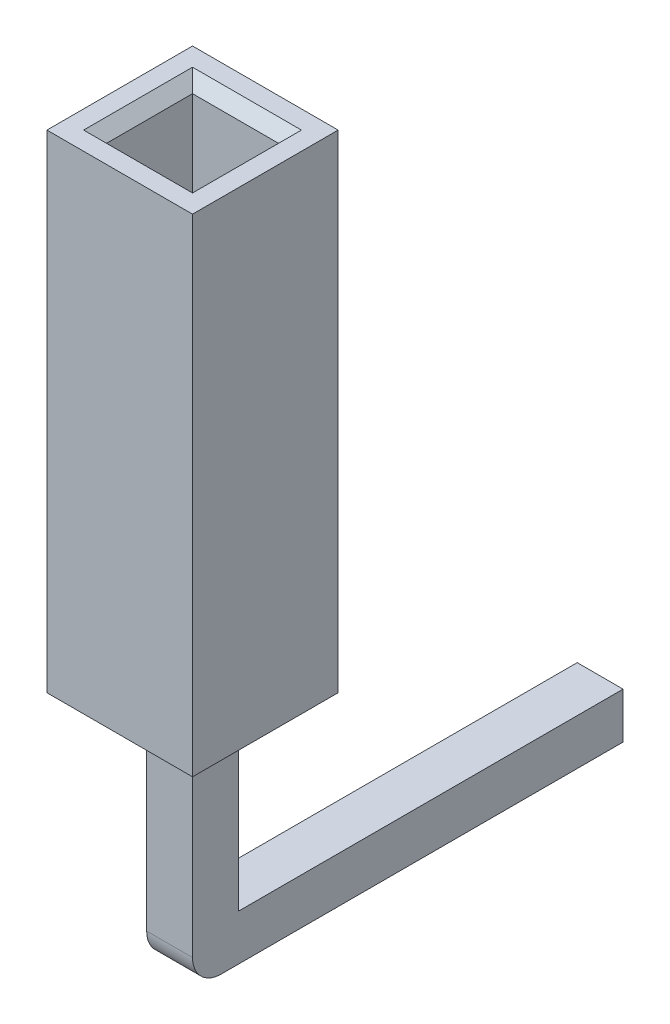
ISO-10303-21;
HEADER;
FILE_DESCRIPTION(('STEP AP214'),'2;1');
FILE_NAME('part.step','',(''),(''),'','','');
FILE_SCHEMA(('AUTOMOTIVE_DESIGN { 1 0 10303 214 1 1 1 1 }'));
ENDSEC;
DATA;
#1=APPLICATION_CONTEXT('core data for automotive mechanical design processes');
#2=APPLICATION_PROTOCOL_DEFINITION('international standard','automotive_design',2000,#1);
#3=PRODUCT_CONTEXT('',#1,'mechanical');
#4=PRODUCT('Part','Part','',(#3));
#5=PRODUCT_RELATED_PRODUCT_CATEGORY('part','',(#4));
#6=PRODUCT_DEFINITION_FORMATION('','',#4);
#7=PRODUCT_DEFINITION_CONTEXT('part definition',#1,'design');
#8=PRODUCT_DEFINITION('design','',#6,#7);
#9=PRODUCT_DEFINITION_SHAPE('','',#8);
#10=(LENGTH_UNIT() NAMED_UNIT(*) SI_UNIT(.MILLI.,.METRE.));
#11=(NAMED_UNIT(*) PLANE_ANGLE_UNIT() SI_UNIT($,.RADIAN.));
#12=(NAMED_UNIT(*) SI_UNIT($,.STERADIAN.) SOLID_ANGLE_UNIT());
#13=UNCERTAINTY_MEASURE_WITH_UNIT(LENGTH_MEASURE(1.E-05),#10,'distance_accuracy_value','');
#14=(GEOMETRIC_REPRESENTATION_CONTEXT(3) GLOBAL_UNCERTAINTY_ASSIGNED_CONTEXT((#13)) GLOBAL_UNIT_ASSIGNED_CONTEXT((#10,
#11,#12)) REPRESENTATION_CONTEXT('',''));
#15=CARTESIAN_POINT('',(0.,0.,0.));
#16=DIRECTION('',(0.,0.,1.));
#17=DIRECTION('',(1.,0.,0.));
#18=AXIS2_PLACEMENT_3D('',#15,#16,#17);
#19=CARTESIAN_POINT('',(0.87,-4.1,-0.87));
#20=DIRECTION('',(0.,-1.,0.));
#21=DIRECTION('',(0.,0.,-1.));
#22=AXIS2_PLACEMENT_3D('',#19,#20,#21);
#23=PLANE('',#22);
#24=DIRECTION('',(0.,0.,-1.));
#25=VECTOR('',#24,1.);
#26=CARTESIAN_POINT('',(1.67,-4.1,-0.87));
#27=LINE('',#26,#25);
#28=CARTESIAN_POINT('',(1.67,-4.1,-1.37));
#29=VERTEX_POINT('',#28);
#30=CARTESIAN_POINT('',(1.67,-4.1,-8.38));
#31=VERTEX_POINT('',#30);
#32=EDGE_CURVE('E151',#29,#31,#27,.T.);
#33=ORIENTED_EDGE('',*,*,#32,.F.);
#34=DIRECTION('',(-1.,0.,0.));
#35=VECTOR('',#34,1.);
#36=CARTESIAN_POINT('',(0.87,-4.1,-1.37));
#37=LINE('',#36,#35);
#38=CARTESIAN_POINT('',(0.87,-4.1,-1.37));
#39=VERTEX_POINT('',#38);
#40=EDGE_CURVE('E181',#29,#39,#37,.T.);
#41=ORIENTED_EDGE('',*,*,#40,.T.);
#42=DIRECTION('',(0.,0.,-1.));
#43=VECTOR('',#42,1.);
#44=CARTESIAN_POINT('',(0.87,-4.1,-0.87));
#45=LINE('',#44,#43);
#46=CARTESIAN_POINT('',(0.87,-4.1,-8.38));
#47=VERTEX_POINT('',#46);
#48=EDGE_CURVE('E159',#39,#47,#45,.T.);
#49=ORIENTED_EDGE('',*,*,#48,.T.);
#50=DIRECTION('',(1.,0.,0.));
#51=VECTOR('',#50,1.);
#52=CARTESIAN_POINT('',(0.87,-4.1,-8.38));
#53=LINE('',#52,#51);
#54=EDGE_CURVE('E176',#47,#31,#53,.T.);
#55=ORIENTED_EDGE('',*,*,#54,.T.);
#56=EDGE_LOOP('',(#33,#41,#49,#55));
#57=FACE_BOUND('',#56,.T.);
#58=ADVANCED_FACE('F47',(#57),#23,.T.);
#59=CARTESIAN_POINT('',(0.87,-3.3,-1.67));
#60=DIRECTION('',(0.,1.,0.));
#61=DIRECTION('',(0.,0.,1.));
#62=AXIS2_PLACEMENT_3D('',#59,#60,#61);
#63=PLANE('',#62);
#64=DIRECTION('',(0.,0.,-1.));
#65=VECTOR('',#64,1.);
#66=CARTESIAN_POINT('',(1.67,-3.3,-1.67));
#67=LINE('',#66,#65);
#68=CARTESIAN_POINT('',(1.67,-3.3,-1.67));
#69=VERTEX_POINT('',#68);
#70=CARTESIAN_POINT('',(1.67,-3.3,-8.38));
#71=VERTEX_POINT('',#70);
#72=EDGE_CURVE('E153',#69,#71,#67,.T.);
#73=ORIENTED_EDGE('',*,*,#72,.T.);
#74=DIRECTION('',(-1.,0.,0.));
#75=VECTOR('',#74,1.);
#76=CARTESIAN_POINT('',(0.87,-3.3,-8.38));
#77=LINE('',#76,#75);
#78=CARTESIAN_POINT('',(0.87,-3.3,-8.38));
#79=VERTEX_POINT('',#78);
#80=EDGE_CURVE('E161',#71,#79,#77,.T.);
#81=ORIENTED_EDGE('',*,*,#80,.T.);
#82=DIRECTION('',(0.,0.,-1.));
#83=VECTOR('',#82,1.);
#84=CARTESIAN_POINT('',(0.87,-3.3,-1.67));
#85=LINE('',#84,#83);
#86=CARTESIAN_POINT('',(0.87,-3.3,-1.67));
#87=VERTEX_POINT('',#86);
#88=EDGE_CURVE('E156',#87,#79,#85,.T.);
#89=ORIENTED_EDGE('',*,*,#88,.F.);
#90=DIRECTION('',(1.,0.,0.));
#91=VECTOR('',#90,1.);
#92=CARTESIAN_POINT('',(0.87,-3.3,-1.67));
#93=LINE('',#92,#91);
#94=EDGE_CURVE('E122',#87,#69,#93,.T.);
#95=ORIENTED_EDGE('',*,*,#94,.T.);
#96=EDGE_LOOP('',(#73,#81,#89,#95));
#97=FACE_BOUND('',#96,.T.);
#98=ADVANCED_FACE('F220',(#97),#63,.T.);
#99=CARTESIAN_POINT('',(0.87,-4.83137084989847,-0.87));
#100=DIRECTION('',(0.,0.,-1.));
#101=DIRECTION('',(0.,1.,0.));
#102=AXIS2_PLACEMENT_3D('',#99,#100,#101);
#103=PLANE('',#102);
#104=DIRECTION('',(0.,1.,0.));
#105=VECTOR('',#104,1.);
#106=CARTESIAN_POINT('',(0.87,-4.83137084989847,-0.87));
#107=LINE('',#106,#105);
#108=CARTESIAN_POINT('',(0.87,-3.6,-0.87));
#109=VERTEX_POINT('',#108);
#110=CARTESIAN_POINT('',(0.87,0.,-0.87));
#111=VERTEX_POINT('',#110);
#112=EDGE_CURVE('E123',#109,#111,#107,.T.);
#113=ORIENTED_EDGE('',*,*,#112,.F.);
#114=DIRECTION('',(-1.,0.,0.));
#115=VECTOR('',#114,1.);
#116=CARTESIAN_POINT('',(1.67,-3.6,-0.87));
#117=LINE('',#116,#115);
#118=CARTESIAN_POINT('',(1.67,-3.6,-0.87));
#119=VERTEX_POINT('',#118);
#120=EDGE_CURVE('E55',#109,#119,#117,.F.);
#121=ORIENTED_EDGE('',*,*,#120,.T.);
#122=DIRECTION('',(0.,1.,0.));
#123=VECTOR('',#122,1.);
#124=CARTESIAN_POINT('',(1.67,-4.83137084989847,-0.87));
#125=LINE('',#124,#123);
#126=CARTESIAN_POINT('',(1.67,0.,-0.87));
#127=VERTEX_POINT('',#126);
#128=EDGE_CURVE('E114',#119,#127,#125,.T.);
#129=ORIENTED_EDGE('',*,*,#128,.T.);
#130=DIRECTION('',(-1.,0.,0.));
#131=VECTOR('',#130,1.);
#132=CARTESIAN_POINT('',(0.87,0.,-0.87));
#133=LINE('',#132,#131);
#134=EDGE_CURVE('E117',#127,#111,#133,.T.);
#135=ORIENTED_EDGE('',*,*,#134,.T.);
#136=EDGE_LOOP('',(#113,#121,#129,#135));
#137=FACE_BOUND('',#136,.T.);
#138=ADVANCED_FACE('F116',(#137),#103,.F.);
#139=CARTESIAN_POINT('',(0.87,-4.83137084989847,-0.87));
#140=DIRECTION('',(1.,0.,0.));
#141=DIRECTION('',(0.,0.,-1.));
#142=AXIS2_PLACEMENT_3D('',#139,#140,#141);
#143=PLANE('',#142);
#144=ORIENTED_EDGE('',*,*,#48,.F.);
#145=CARTESIAN_POINT('',(0.87,-3.6,-1.37));
#146=DIRECTION('',(1.,0.,0.));
#147=DIRECTION('',(0.,0.,-1.));
#148=AXIS2_PLACEMENT_3D('',#145,#146,#147);
#149=CIRCLE('',#148,0.5);
#150=EDGE_CURVE('E69',#39,#109,#149,.F.);
#151=ORIENTED_EDGE('',*,*,#150,.T.);
#152=ORIENTED_EDGE('',*,*,#112,.T.);
#153=DIRECTION('',(0.,0.,-1.));
#154=VECTOR('',#153,1.);
#155=CARTESIAN_POINT('',(0.87,0.,-0.87));
#156=LINE('',#155,#154);
#157=CARTESIAN_POINT('',(0.87,0.,-1.67));
#158=VERTEX_POINT('',#157);
#159=EDGE_CURVE('E131',#111,#158,#156,.T.);
#160=ORIENTED_EDGE('',*,*,#159,.T.);
#161=DIRECTION('',(0.,1.,0.));
#162=VECTOR('',#161,1.);
#163=CARTESIAN_POINT('',(0.87,-4.83137084989847,-1.67));
#164=LINE('',#163,#162);
#165=EDGE_CURVE('E148',#87,#158,#164,.T.);
#166=ORIENTED_EDGE('',*,*,#165,.F.);
#167=ORIENTED_EDGE('',*,*,#88,.T.);
#168=DIRECTION('',(0.,-1.,0.));
#169=VECTOR('',#168,1.);
#170=CARTESIAN_POINT('',(0.870000000000002,-4.1,-8.38));
#171=LINE('',#170,#169);
#172=EDGE_CURVE('E173',#79,#47,#171,.T.);
#173=ORIENTED_EDGE('',*,*,#172,.T.);
#174=EDGE_LOOP('',(#144,#151,#152,#160,#166,#167,#173));
#175=FACE_BOUND('',#174,.T.);
#176=ADVANCED_FACE('F194',(#175),#143,.F.);
#177=CARTESIAN_POINT('',(0.87,-4.83137084989847,-1.67));
#178=DIRECTION('',(0.,0.,1.));
#179=DIRECTION('',(0.,-1.,0.));
#180=AXIS2_PLACEMENT_3D('',#177,#178,#179);
#181=PLANE('',#180);
#182=ORIENTED_EDGE('',*,*,#94,.F.);
#183=ORIENTED_EDGE('',*,*,#165,.T.);
#184=DIRECTION('',(1.,0.,0.));
#185=VECTOR('',#184,1.);
#186=CARTESIAN_POINT('',(0.87,0.,-1.67));
#187=LINE('',#186,#185);
#188=CARTESIAN_POINT('',(1.67,0.,-1.67));
#189=VERTEX_POINT('',#188);
#190=EDGE_CURVE('E145',#158,#189,#187,.T.);
#191=ORIENTED_EDGE('',*,*,#190,.T.);
#192=DIRECTION('',(0.,1.,0.));
#193=VECTOR('',#192,1.);
#194=CARTESIAN_POINT('',(1.67,-4.83137084989847,-1.67));
#195=LINE('',#194,#193);
#196=EDGE_CURVE('E135',#69,#189,#195,.T.);
#197=ORIENTED_EDGE('',*,*,#196,.F.);
#198=EDGE_LOOP('',(#182,#183,#191,#197));
#199=FACE_BOUND('',#198,.T.);
#200=ADVANCED_FACE('F223',(#199),#181,.F.);
#201=CARTESIAN_POINT('',(1.67,-4.83137084989847,-0.87));
#202=DIRECTION('',(-1.,0.,0.));
#203=DIRECTION('',(0.,0.,1.));
#204=AXIS2_PLACEMENT_3D('',#201,#202,#203);
#205=PLANE('',#204);
#206=ORIENTED_EDGE('',*,*,#128,.F.);
#207=CARTESIAN_POINT('',(1.67,-3.6,-1.37));
#208=DIRECTION('',(-1.,0.,0.));
#209=DIRECTION('',(0.,0.,1.));
#210=AXIS2_PLACEMENT_3D('',#207,#208,#209);
#211=CIRCLE('',#210,0.5);
#212=EDGE_CURVE('E13',#119,#29,#211,.F.);
#213=ORIENTED_EDGE('',*,*,#212,.T.);
#214=ORIENTED_EDGE('',*,*,#32,.T.);
#215=DIRECTION('',(0.,1.,0.));
#216=VECTOR('',#215,1.);
#217=CARTESIAN_POINT('',(1.67,-3.3,-8.38));
#218=LINE('',#217,#216);
#219=EDGE_CURVE('E179',#31,#71,#218,.T.);
#220=ORIENTED_EDGE('',*,*,#219,.T.);
#221=ORIENTED_EDGE('',*,*,#72,.F.);
#222=ORIENTED_EDGE('',*,*,#196,.T.);
#223=DIRECTION('',(0.,0.,1.));
#224=VECTOR('',#223,1.);
#225=CARTESIAN_POINT('',(1.67,0.,-0.87));
#226=LINE('',#225,#224);
#227=EDGE_CURVE('E129',#189,#127,#226,.T.);
#228=ORIENTED_EDGE('',*,*,#227,.T.);
#229=EDGE_LOOP('',(#206,#213,#214,#220,#221,#222,#228));
#230=FACE_BOUND('',#229,.T.);
#231=ADVANCED_FACE('F133',(#230),#205,.F.);
#232=CARTESIAN_POINT('',(0.,0.,0.));
#233=DIRECTION('',(0.,-1.,0.));
#234=DIRECTION('',(0.,0.,-1.));
#235=AXIS2_PLACEMENT_3D('',#232,#233,#234);
#236=PLANE('',#235);
#237=ORIENTED_EDGE('',*,*,#227,.F.);
#238=ORIENTED_EDGE('',*,*,#190,.F.);
#239=ORIENTED_EDGE('',*,*,#159,.F.);
#240=ORIENTED_EDGE('',*,*,#134,.F.);
#241=EDGE_LOOP('',(#237,#238,#239,#240));
#242=FACE_BOUND('',#241,.T.);
#243=ADVANCED_FACE('F127',(#242),#236,.F.);
#244=CARTESIAN_POINT('',(1.27,-3.7,-8.58));
#245=DIRECTION('',(0.,0.,-1.));
#246=DIRECTION('',(-1.,0.,0.));
#247=AXIS2_PLACEMENT_3D('',#244,#245,#246);
#248=PLANE('',#247);
#249=DIRECTION('',(0.,1.,0.));
#250=VECTOR('',#249,1.);
#251=CARTESIAN_POINT('',(1.07,-3.3,-8.58));
#252=LINE('',#251,#250);
#253=CARTESIAN_POINT('',(1.07,-3.9,-8.58));
#254=VERTEX_POINT('',#253);
#255=CARTESIAN_POINT('',(1.07,-3.5,-8.58));
#256=VERTEX_POINT('',#255);
#257=EDGE_CURVE('E168',#254,#256,#252,.T.);
#258=ORIENTED_EDGE('',*,*,#257,.T.);
#259=DIRECTION('',(1.,0.,0.));
#260=VECTOR('',#259,1.);
#261=CARTESIAN_POINT('',(1.27,-3.5,-8.58));
#262=LINE('',#261,#260);
#263=CARTESIAN_POINT('',(1.47,-3.5,-8.58));
#264=VERTEX_POINT('',#263);
#265=EDGE_CURVE('E170',#256,#264,#262,.T.);
#266=ORIENTED_EDGE('',*,*,#265,.T.);
#267=DIRECTION('',(0.,-1.,0.));
#268=VECTOR('',#267,1.);
#269=CARTESIAN_POINT('',(1.47,-4.1,-8.58));
#270=LINE('',#269,#268);
#271=CARTESIAN_POINT('',(1.47,-3.9,-8.58));
#272=VERTEX_POINT('',#271);
#273=EDGE_CURVE('E164',#264,#272,#270,.T.);
#274=ORIENTED_EDGE('',*,*,#273,.T.);
#275=DIRECTION('',(-1.,0.,0.));
#276=VECTOR('',#275,1.);
#277=CARTESIAN_POINT('',(1.27,-3.9,-8.58));
#278=LINE('',#277,#276);
#279=EDGE_CURVE('E166',#272,#254,#278,.T.);
#280=ORIENTED_EDGE('',*,*,#279,.T.);
#281=EDGE_LOOP('',(#258,#266,#274,#280));
#282=FACE_BOUND('',#281,.T.);
#283=ADVANCED_FACE('F210',(#282),#248,.T.);
#284=CARTESIAN_POINT('',(0.87,-4.1,-8.38));
#285=DIRECTION('',(0.,0.707106781186547,0.707106781186547));
#286=DIRECTION('',(1.,0.,0.));
#287=AXIS2_PLACEMENT_3D('',#284,#285,#286);
#288=PLANE('',#287);
#289=DIRECTION('',(-0.577350269189626,-0.577350269189626,0.577350269189626));
#290=VECTOR('',#289,1.);
#291=CARTESIAN_POINT('',(0.870000000000001,-4.1,-8.38));
#292=LINE('',#291,#290);
#293=EDGE_CURVE('E140',#254,#47,#292,.T.);
#294=ORIENTED_EDGE('',*,*,#293,.F.);
#295=ORIENTED_EDGE('',*,*,#279,.F.);
#296=DIRECTION('',(0.577350269189626,-0.577350269189626,0.577350269189626));
#297=VECTOR('',#296,1.);
#298=CARTESIAN_POINT('',(1.91379028329949,-4.34379028329949,-8.13620971670051));
#299=LINE('',#298,#297);
#300=EDGE_CURVE('E137',#31,#272,#299,.F.);
#301=ORIENTED_EDGE('',*,*,#300,.F.);
#302=ORIENTED_EDGE('',*,*,#54,.F.);
#303=EDGE_LOOP('',(#294,#295,#301,#302));
#304=FACE_BOUND('',#303,.T.);
#305=ADVANCED_FACE('F203',(#304),#288,.F.);
#306=CARTESIAN_POINT('',(1.67,-4.83137084989847,-8.38));
#307=DIRECTION('',(0.707106781186547,0.,-0.707106781186547));
#308=DIRECTION('',(0.,-1.,0.));
#309=AXIS2_PLACEMENT_3D('',#306,#307,#308);
#310=PLANE('',#309);
#311=ORIENTED_EDGE('',*,*,#300,.T.);
#312=ORIENTED_EDGE('',*,*,#273,.F.);
#313=DIRECTION('',(-0.577350269189626,-0.577350269189626,-0.577350269189626));
#314=VECTOR('',#313,1.);
#315=CARTESIAN_POINT('',(1.15954305003384,-3.81045694996616,-8.89045694996616));
#316=LINE('',#315,#314);
#317=EDGE_CURVE('E184',#71,#264,#316,.T.);
#318=ORIENTED_EDGE('',*,*,#317,.F.);
#319=ORIENTED_EDGE('',*,*,#219,.F.);
#320=EDGE_LOOP('',(#311,#312,#318,#319));
#321=FACE_BOUND('',#320,.T.);
#322=ADVANCED_FACE('F217',(#321),#310,.T.);
#323=CARTESIAN_POINT('',(0.870000000000002,-4.83137084989847,-8.38));
#324=DIRECTION('',(-0.707106781186548,0.,-0.707106781186547));
#325=DIRECTION('',(0.,1.,0.));
#326=AXIS2_PLACEMENT_3D('',#323,#324,#325);
#327=PLANE('',#326);
#328=ORIENTED_EDGE('',*,*,#293,.T.);
#329=ORIENTED_EDGE('',*,*,#172,.F.);
#330=DIRECTION('',(-0.577350269189626,0.577350269189626,0.577350269189626));
#331=VECTOR('',#330,1.);
#332=CARTESIAN_POINT('',(1.38045694996616,-3.81045694996616,-8.89045694996616));
#333=LINE('',#332,#331);
#334=EDGE_CURVE('E182',#256,#79,#333,.T.);
#335=ORIENTED_EDGE('',*,*,#334,.F.);
#336=ORIENTED_EDGE('',*,*,#257,.F.);
#337=EDGE_LOOP('',(#328,#329,#335,#336));
#338=FACE_BOUND('',#337,.T.);
#339=ADVANCED_FACE('F207',(#338),#327,.T.);
#340=CARTESIAN_POINT('',(0.87,-3.3,-8.38));
#341=DIRECTION('',(0.,-0.707106781186547,0.707106781186547));
#342=DIRECTION('',(-1.,0.,0.));
#343=AXIS2_PLACEMENT_3D('',#340,#341,#342);
#344=PLANE('',#343);
#345=ORIENTED_EDGE('',*,*,#317,.T.);
#346=ORIENTED_EDGE('',*,*,#265,.F.);
#347=ORIENTED_EDGE('',*,*,#334,.T.);
#348=ORIENTED_EDGE('',*,*,#80,.F.);
#349=EDGE_LOOP('',(#345,#346,#347,#348));
#350=FACE_BOUND('',#349,.T.);
#351=ADVANCED_FACE('F212',(#350),#344,.F.);
#352=CARTESIAN_POINT('',(0.87,-3.6,-1.37));
#353=DIRECTION('',(1.,0.,0.));
#354=DIRECTION('',(0.,0.,-1.));
#355=AXIS2_PLACEMENT_3D('',#352,#353,#354);
#356=CYLINDRICAL_SURFACE('',#355,0.5);
#357=ORIENTED_EDGE('',*,*,#212,.F.);
#358=ORIENTED_EDGE('',*,*,#120,.F.);
#359=ORIENTED_EDGE('',*,*,#150,.F.);
#360=ORIENTED_EDGE('',*,*,#40,.F.);
#361=EDGE_LOOP('',(#357,#358,#359,#360));
#362=FACE_BOUND('',#361,.T.);
#363=ADVANCED_FACE('F49',(#362),#356,.T.);
#364=CLOSED_SHELL('',(#58,#98,#138,#176,#200,#231,#243,#283,#305,#322,#339,#351,#363));
#365=MANIFOLD_SOLID_BREP('B2',#364);
#366=CARTESIAN_POINT('',(0.,8.5,0.));
#367=DIRECTION('',(0.,-1.,0.));
#368=DIRECTION('',(0.,0.,-1.));
#369=AXIS2_PLACEMENT_3D('',#366,#367,#368);
#370=PLANE('',#369);
#371=DIRECTION('',(0.,0.,-1.));
#372=VECTOR('',#371,1.);
#373=CARTESIAN_POINT('',(0.320000000000002,8.5,-2.02));
#374=LINE('',#373,#372);
#375=CARTESIAN_POINT('',(0.320000000000002,8.5,-0.320000000000002));
#376=VERTEX_POINT('',#375);
#377=CARTESIAN_POINT('',(0.320000000000002,8.5,-2.22));
#378=VERTEX_POINT('',#377);
#379=EDGE_CURVE('E478',#376,#378,#374,.T.);
#380=ORIENTED_EDGE('',*,*,#379,.T.);
#381=DIRECTION('',(1.,0.,0.));
#382=VECTOR('',#381,1.);
#383=CARTESIAN_POINT('',(2.02,8.5,-2.22));
#384=LINE('',#383,#382);
#385=CARTESIAN_POINT('',(2.22,8.5,-2.22));
#386=VERTEX_POINT('',#385);
#387=EDGE_CURVE('E484',#378,#386,#384,.T.);
#388=ORIENTED_EDGE('',*,*,#387,.T.);
#389=DIRECTION('',(0.,0.,1.));
#390=VECTOR('',#389,1.);
#391=CARTESIAN_POINT('',(2.22,8.5,-0.52));
#392=LINE('',#391,#390);
#393=CARTESIAN_POINT('',(2.22,8.5,-0.320000000000002));
#394=VERTEX_POINT('',#393);
#395=EDGE_CURVE('E482',#386,#394,#392,.T.);
#396=ORIENTED_EDGE('',*,*,#395,.T.);
#397=DIRECTION('',(-1.,0.,0.));
#398=VECTOR('',#397,1.);
#399=CARTESIAN_POINT('',(0.520000000000001,8.5,-0.320000000000002));
#400=LINE('',#399,#398);
#401=EDGE_CURVE('E480',#394,#376,#400,.T.);
#402=ORIENTED_EDGE('',*,*,#401,.T.);
#403=EDGE_LOOP('',(#380,#388,#396,#402));
#404=FACE_BOUND('',#403,.T.);
#405=DIRECTION('',(0.,0.,1.));
#406=VECTOR('',#405,1.);
#407=CARTESIAN_POINT('',(0.,8.5,0.));
#408=LINE('',#407,#406);
#409=CARTESIAN_POINT('',(0.,8.5,-2.54));
#410=VERTEX_POINT('',#409);
#411=CARTESIAN_POINT('',(0.,8.5,0.));
#412=VERTEX_POINT('',#411);
#413=EDGE_CURVE('E447',#410,#412,#408,.T.);
#414=ORIENTED_EDGE('',*,*,#413,.T.);
#415=DIRECTION('',(1.,0.,0.));
#416=VECTOR('',#415,1.);
#417=CARTESIAN_POINT('',(0.,8.5,0.));
#418=LINE('',#417,#416);
#419=CARTESIAN_POINT('',(2.54,8.5,0.));
#420=VERTEX_POINT('',#419);
#421=EDGE_CURVE('E450',#412,#420,#418,.T.);
#422=ORIENTED_EDGE('',*,*,#421,.T.);
#423=DIRECTION('',(0.,0.,-1.));
#424=VECTOR('',#423,1.);
#425=CARTESIAN_POINT('',(2.54,8.5,0.));
#426=LINE('',#425,#424);
#427=CARTESIAN_POINT('',(2.54,8.5,-2.54));
#428=VERTEX_POINT('',#427);
#429=EDGE_CURVE('E453',#420,#428,#426,.T.);
#430=ORIENTED_EDGE('',*,*,#429,.T.);
#431=DIRECTION('',(-1.,0.,0.));
#432=VECTOR('',#431,1.);
#433=CARTESIAN_POINT('',(0.,8.5,-2.54));
#434=LINE('',#433,#432);
#435=EDGE_CURVE('E455',#428,#410,#434,.T.);
#436=ORIENTED_EDGE('',*,*,#435,.T.);
#437=EDGE_LOOP('',(#414,#422,#430,#436));
#438=FACE_BOUND('',#437,.T.);
#439=ADVANCED_FACE('F334',(#404,#438),#370,.F.);
#440=CARTESIAN_POINT('',(0.,0.,0.));
#441=DIRECTION('',(0.,-1.,0.));
#442=DIRECTION('',(0.,0.,-1.));
#443=AXIS2_PLACEMENT_3D('',#440,#441,#442);
#444=PLANE('',#443);
#445=DIRECTION('',(0.,0.,1.));
#446=VECTOR('',#445,1.);
#447=CARTESIAN_POINT('',(0.,0.,0.));
#448=LINE('',#447,#446);
#449=CARTESIAN_POINT('',(0.,0.,-2.54));
#450=VERTEX_POINT('',#449);
#451=CARTESIAN_POINT('',(0.,0.,0.));
#452=VERTEX_POINT('',#451);
#453=EDGE_CURVE('E422',#450,#452,#448,.T.);
#454=ORIENTED_EDGE('',*,*,#453,.F.);
#455=DIRECTION('',(-1.,0.,0.));
#456=VECTOR('',#455,1.);
#457=CARTESIAN_POINT('',(0.,0.,-2.54));
#458=LINE('',#457,#456);
#459=CARTESIAN_POINT('',(2.54,0.,-2.54));
#460=VERTEX_POINT('',#459);
#461=EDGE_CURVE('E451',#460,#450,#458,.T.);
#462=ORIENTED_EDGE('',*,*,#461,.F.);
#463=DIRECTION('',(0.,0.,-1.));
#464=VECTOR('',#463,1.);
#465=CARTESIAN_POINT('',(2.54,0.,0.));
#466=LINE('',#465,#464);
#467=CARTESIAN_POINT('',(2.54,0.,0.));
#468=VERTEX_POINT('',#467);
#469=EDGE_CURVE('E462',#468,#460,#466,.T.);
#470=ORIENTED_EDGE('',*,*,#469,.F.);
#471=DIRECTION('',(1.,0.,0.));
#472=VECTOR('',#471,1.);
#473=CARTESIAN_POINT('',(0.,0.,0.));
#474=LINE('',#473,#472);
#475=EDGE_CURVE('E460',#452,#468,#474,.T.);
#476=ORIENTED_EDGE('',*,*,#475,.F.);
#477=EDGE_LOOP('',(#454,#462,#470,#476));
#478=FACE_BOUND('',#477,.T.);
#479=DIRECTION('',(1.,0.,0.));
#480=VECTOR('',#479,1.);
#481=CARTESIAN_POINT('',(0.520000000000001,0.,-0.52));
#482=LINE('',#481,#480);
#483=CARTESIAN_POINT('',(0.520000000000001,0.,-0.52));
#484=VERTEX_POINT('',#483);
#485=CARTESIAN_POINT('',(2.02,0.,-0.52));
#486=VERTEX_POINT('',#485);
#487=EDGE_CURVE('E435',#484,#486,#482,.T.);
#488=ORIENTED_EDGE('',*,*,#487,.T.);
#489=DIRECTION('',(0.,0.,-1.));
#490=VECTOR('',#489,1.);
#491=CARTESIAN_POINT('',(2.02,0.,-2.02));
#492=LINE('',#491,#490);
#493=CARTESIAN_POINT('',(2.02,0.,-2.02));
#494=VERTEX_POINT('',#493);
#495=EDGE_CURVE('E415',#486,#494,#492,.T.);
#496=ORIENTED_EDGE('',*,*,#495,.T.);
#497=DIRECTION('',(-1.,0.,0.));
#498=VECTOR('',#497,1.);
#499=CARTESIAN_POINT('',(0.52,0.,-2.02));
#500=LINE('',#499,#498);
#501=CARTESIAN_POINT('',(0.52,0.,-2.02));
#502=VERTEX_POINT('',#501);
#503=EDGE_CURVE('E426',#494,#502,#500,.T.);
#504=ORIENTED_EDGE('',*,*,#503,.T.);
#505=DIRECTION('',(0.,0.,1.));
#506=VECTOR('',#505,1.);
#507=CARTESIAN_POINT('',(0.52,0.,-2.02));
#508=LINE('',#507,#506);
#509=EDGE_CURVE('E431',#502,#484,#508,.T.);
#510=ORIENTED_EDGE('',*,*,#509,.T.);
#511=EDGE_LOOP('',(#488,#496,#504,#510));
#512=FACE_BOUND('',#511,.T.);
#513=ADVANCED_FACE('F433',(#478,#512),#444,.T.);
#514=CARTESIAN_POINT('',(0.,8.5,0.));
#515=DIRECTION('',(1.,0.,0.));
#516=DIRECTION('',(0.,0.,-1.));
#517=AXIS2_PLACEMENT_3D('',#514,#515,#516);
#518=PLANE('',#517);
#519=ORIENTED_EDGE('',*,*,#453,.T.);
#520=DIRECTION('',(0.,-1.,0.));
#521=VECTOR('',#520,1.);
#522=CARTESIAN_POINT('',(0.,8.5,0.));
#523=LINE('',#522,#521);
#524=EDGE_CURVE('E473',#412,#452,#523,.T.);
#525=ORIENTED_EDGE('',*,*,#524,.F.);
#526=ORIENTED_EDGE('',*,*,#413,.F.);
#527=DIRECTION('',(0.,-1.,0.));
#528=VECTOR('',#527,1.);
#529=CARTESIAN_POINT('',(0.,8.5,-2.54));
#530=LINE('',#529,#528);
#531=EDGE_CURVE('E457',#410,#450,#530,.T.);
#532=ORIENTED_EDGE('',*,*,#531,.T.);
#533=EDGE_LOOP('',(#519,#525,#526,#532));
#534=FACE_BOUND('',#533,.T.);
#535=ADVANCED_FACE('F523',(#534),#518,.F.);
#536=CARTESIAN_POINT('',(0.,8.5,0.));
#537=DIRECTION('',(0.,0.,-1.));
#538=DIRECTION('',(-1.,0.,0.));
#539=AXIS2_PLACEMENT_3D('',#536,#537,#538);
#540=PLANE('',#539);
#541=ORIENTED_EDGE('',*,*,#475,.T.);
#542=DIRECTION('',(0.,-1.,0.));
#543=VECTOR('',#542,1.);
#544=CARTESIAN_POINT('',(2.54,8.5,0.));
#545=LINE('',#544,#543);
#546=EDGE_CURVE('E470',#420,#468,#545,.T.);
#547=ORIENTED_EDGE('',*,*,#546,.F.);
#548=ORIENTED_EDGE('',*,*,#421,.F.);
#549=ORIENTED_EDGE('',*,*,#524,.T.);
#550=EDGE_LOOP('',(#541,#547,#548,#549));
#551=FACE_BOUND('',#550,.T.);
#552=ADVANCED_FACE('F537',(#551),#540,.F.);
#553=CARTESIAN_POINT('',(2.54,8.5,0.));
#554=DIRECTION('',(-1.,0.,0.));
#555=DIRECTION('',(0.,0.,1.));
#556=AXIS2_PLACEMENT_3D('',#553,#554,#555);
#557=PLANE('',#556);
#558=ORIENTED_EDGE('',*,*,#469,.T.);
#559=DIRECTION('',(0.,-1.,0.));
#560=VECTOR('',#559,1.);
#561=CARTESIAN_POINT('',(2.54,8.5,-2.54));
#562=LINE('',#561,#560);
#563=EDGE_CURVE('E467',#428,#460,#562,.T.);
#564=ORIENTED_EDGE('',*,*,#563,.F.);
#565=ORIENTED_EDGE('',*,*,#429,.F.);
#566=ORIENTED_EDGE('',*,*,#546,.T.);
#567=EDGE_LOOP('',(#558,#564,#565,#566));
#568=FACE_BOUND('',#567,.T.);
#569=ADVANCED_FACE('F533',(#568),#557,.F.);
#570=CARTESIAN_POINT('',(0.,8.5,-2.54));
#571=DIRECTION('',(0.,0.,1.));
#572=DIRECTION('',(1.,0.,0.));
#573=AXIS2_PLACEMENT_3D('',#570,#571,#572);
#574=PLANE('',#573);
#575=ORIENTED_EDGE('',*,*,#461,.T.);
#576=ORIENTED_EDGE('',*,*,#531,.F.);
#577=ORIENTED_EDGE('',*,*,#435,.F.);
#578=ORIENTED_EDGE('',*,*,#563,.T.);
#579=EDGE_LOOP('',(#575,#576,#577,#578));
#580=FACE_BOUND('',#579,.T.);
#581=ADVANCED_FACE('F530',(#580),#574,.F.);
#582=CARTESIAN_POINT('',(2.02,8.5,-2.02));
#583=DIRECTION('',(-1.,0.,0.));
#584=DIRECTION('',(0.,0.,1.));
#585=AXIS2_PLACEMENT_3D('',#582,#583,#584);
#586=PLANE('',#585);
#587=DIRECTION('',(0.,-1.,0.));
#588=VECTOR('',#587,1.);
#589=CARTESIAN_POINT('',(2.02,8.5,-0.52));
#590=LINE('',#589,#588);
#591=CARTESIAN_POINT('',(2.02,8.3,-0.52));
#592=VERTEX_POINT('',#591);
#593=EDGE_CURVE('E442',#592,#486,#590,.T.);
#594=ORIENTED_EDGE('',*,*,#593,.F.);
#595=DIRECTION('',(0.,0.,-1.));
#596=VECTOR('',#595,1.);
#597=CARTESIAN_POINT('',(2.02,8.3,-2.02));
#598=LINE('',#597,#596);
#599=CARTESIAN_POINT('',(2.02,8.3,-2.02));
#600=VERTEX_POINT('',#599);
#601=EDGE_CURVE('E418',#592,#600,#598,.T.);
#602=ORIENTED_EDGE('',*,*,#601,.T.);
#603=DIRECTION('',(0.,-1.,0.));
#604=VECTOR('',#603,1.);
#605=CARTESIAN_POINT('',(2.02,8.5,-2.02));
#606=LINE('',#605,#604);
#607=EDGE_CURVE('E411',#600,#494,#606,.T.);
#608=ORIENTED_EDGE('',*,*,#607,.T.);
#609=ORIENTED_EDGE('',*,*,#495,.F.);
#610=EDGE_LOOP('',(#594,#602,#608,#609));
#611=FACE_BOUND('',#610,.T.);
#612=ADVANCED_FACE('F413',(#611),#586,.T.);
#613=CARTESIAN_POINT('',(0.52,8.5,-2.02));
#614=DIRECTION('',(0.,0.,1.));
#615=DIRECTION('',(1.,0.,0.));
#616=AXIS2_PLACEMENT_3D('',#613,#614,#615);
#617=PLANE('',#616);
#618=ORIENTED_EDGE('',*,*,#607,.F.);
#619=DIRECTION('',(-1.,0.,0.));
#620=VECTOR('',#619,1.);
#621=CARTESIAN_POINT('',(0.52,8.3,-2.02));
#622=LINE('',#621,#620);
#623=CARTESIAN_POINT('',(0.52,8.3,-2.02));
#624=VERTEX_POINT('',#623);
#625=EDGE_CURVE('E476',#600,#624,#622,.T.);
#626=ORIENTED_EDGE('',*,*,#625,.T.);
#627=DIRECTION('',(0.,-1.,0.));
#628=VECTOR('',#627,1.);
#629=CARTESIAN_POINT('',(0.52,8.5,-2.02));
#630=LINE('',#629,#628);
#631=EDGE_CURVE('E423',#624,#502,#630,.T.);
#632=ORIENTED_EDGE('',*,*,#631,.T.);
#633=ORIENTED_EDGE('',*,*,#503,.F.);
#634=EDGE_LOOP('',(#618,#626,#632,#633));
#635=FACE_BOUND('',#634,.T.);
#636=ADVANCED_FACE('F427',(#635),#617,.T.);
#637=CARTESIAN_POINT('',(0.52,8.5,-2.02));
#638=DIRECTION('',(1.,0.,0.));
#639=DIRECTION('',(0.,0.,-1.));
#640=AXIS2_PLACEMENT_3D('',#637,#638,#639);
#641=PLANE('',#640);
#642=ORIENTED_EDGE('',*,*,#631,.F.);
#643=DIRECTION('',(0.,0.,1.));
#644=VECTOR('',#643,1.);
#645=CARTESIAN_POINT('',(0.520000000000001,8.3,-0.52));
#646=LINE('',#645,#644);
#647=CARTESIAN_POINT('',(0.520000000000001,8.3,-0.52));
#648=VERTEX_POINT('',#647);
#649=EDGE_CURVE('E45',#624,#648,#646,.T.);
#650=ORIENTED_EDGE('',*,*,#649,.T.);
#651=DIRECTION('',(0.,-1.,0.));
#652=VECTOR('',#651,1.);
#653=CARTESIAN_POINT('',(0.520000000000001,8.5,-0.52));
#654=LINE('',#653,#652);
#655=EDGE_CURVE('E444',#648,#484,#654,.T.);
#656=ORIENTED_EDGE('',*,*,#655,.T.);
#657=ORIENTED_EDGE('',*,*,#509,.F.);
#658=EDGE_LOOP('',(#642,#650,#656,#657));
#659=FACE_BOUND('',#658,.T.);
#660=ADVANCED_FACE('F508',(#659),#641,.T.);
#661=CARTESIAN_POINT('',(0.520000000000001,8.5,-0.52));
#662=DIRECTION('',(0.,0.,-1.));
#663=DIRECTION('',(-1.,0.,0.));
#664=AXIS2_PLACEMENT_3D('',#661,#662,#663);
#665=PLANE('',#664);
#666=ORIENTED_EDGE('',*,*,#655,.F.);
#667=DIRECTION('',(1.,0.,0.));
#668=VECTOR('',#667,1.);
#669=CARTESIAN_POINT('',(2.02,8.3,-0.52));
#670=LINE('',#669,#668);
#671=EDGE_CURVE('E343',#648,#592,#670,.T.);
#672=ORIENTED_EDGE('',*,*,#671,.T.);
#673=ORIENTED_EDGE('',*,*,#593,.T.);
#674=ORIENTED_EDGE('',*,*,#487,.F.);
#675=EDGE_LOOP('',(#666,#672,#673,#674));
#676=FACE_BOUND('',#675,.T.);
#677=ADVANCED_FACE('F509',(#676),#665,.T.);
#678=CARTESIAN_POINT('',(0.520000000000001,8.3,-0.52));
#679=DIRECTION('',(0.,0.707106781186548,-0.707106781186548));
#680=DIRECTION('',(-1.,0.,0.));
#681=AXIS2_PLACEMENT_3D('',#678,#679,#680);
#682=PLANE('',#681);
#683=DIRECTION('',(0.577350269189626,-0.577350269189626,-0.577350269189626));
#684=VECTOR('',#683,1.);
#685=CARTESIAN_POINT('',(0.520000000000001,8.3,-0.52));
#686=LINE('',#685,#684);
#687=EDGE_CURVE('E438',#376,#648,#686,.T.);
#688=ORIENTED_EDGE('',*,*,#687,.F.);
#689=ORIENTED_EDGE('',*,*,#401,.F.);
#690=DIRECTION('',(-0.577350269189626,-0.577350269189626,-0.577350269189625));
#691=VECTOR('',#690,1.);
#692=CARTESIAN_POINT('',(1.52,7.8,-1.02));
#693=LINE('',#692,#691);
#694=EDGE_CURVE('E338',#592,#394,#693,.F.);
#695=ORIENTED_EDGE('',*,*,#694,.F.);
#696=ORIENTED_EDGE('',*,*,#671,.F.);
#697=EDGE_LOOP('',(#688,#689,#695,#696));
#698=FACE_BOUND('',#697,.T.);
#699=ADVANCED_FACE('F336',(#698),#682,.T.);
#700=CARTESIAN_POINT('',(2.02,8.3,-2.02));
#701=DIRECTION('',(-0.707106781186547,0.707106781186548,0.));
#702=DIRECTION('',(0.,0.,1.));
#703=AXIS2_PLACEMENT_3D('',#700,#701,#702);
#704=PLANE('',#703);
#705=ORIENTED_EDGE('',*,*,#694,.T.);
#706=ORIENTED_EDGE('',*,*,#395,.F.);
#707=DIRECTION('',(-0.577350269189626,-0.577350269189626,0.577350269189626));
#708=VECTOR('',#707,1.);
#709=CARTESIAN_POINT('',(1.52,7.8,-1.52));
#710=LINE('',#709,#708);
#711=EDGE_CURVE('E491',#600,#386,#710,.F.);
#712=ORIENTED_EDGE('',*,*,#711,.F.);
#713=ORIENTED_EDGE('',*,*,#601,.F.);
#714=EDGE_LOOP('',(#705,#706,#712,#713));
#715=FACE_BOUND('',#714,.T.);
#716=ADVANCED_FACE('F503',(#715),#704,.T.);
#717=CARTESIAN_POINT('',(0.52,8.3,-2.02));
#718=DIRECTION('',(0.707106781186547,0.707106781186547,0.));
#719=DIRECTION('',(0.,0.,-1.));
#720=AXIS2_PLACEMENT_3D('',#717,#718,#719);
#721=PLANE('',#720);
#722=ORIENTED_EDGE('',*,*,#687,.T.);
#723=ORIENTED_EDGE('',*,*,#649,.F.);
#724=DIRECTION('',(-0.577350269189626,0.577350269189626,-0.577350269189626));
#725=VECTOR('',#724,1.);
#726=CARTESIAN_POINT('',(0.52,8.3,-2.02));
#727=LINE('',#726,#725);
#728=EDGE_CURVE('E489',#378,#624,#727,.F.);
#729=ORIENTED_EDGE('',*,*,#728,.F.);
#730=ORIENTED_EDGE('',*,*,#379,.F.);
#731=EDGE_LOOP('',(#722,#723,#729,#730));
#732=FACE_BOUND('',#731,.T.);
#733=ADVANCED_FACE('F496',(#732),#721,.T.);
#734=CARTESIAN_POINT('',(0.52,8.3,-2.02));
#735=DIRECTION('',(0.,0.707106781186548,0.707106781186548));
#736=DIRECTION('',(1.,0.,0.));
#737=AXIS2_PLACEMENT_3D('',#734,#735,#736);
#738=PLANE('',#737);
#739=ORIENTED_EDGE('',*,*,#711,.T.);
#740=ORIENTED_EDGE('',*,*,#387,.F.);
#741=ORIENTED_EDGE('',*,*,#728,.T.);
#742=ORIENTED_EDGE('',*,*,#625,.F.);
#743=EDGE_LOOP('',(#739,#740,#741,#742));
#744=FACE_BOUND('',#743,.T.);
#745=ADVANCED_FACE('F507',(#744),#738,.T.);
#746=CLOSED_SHELL('',(#439,#513,#535,#552,#569,#581,#612,#636,#660,#677,#699,#716,#733,#745));
#747=MANIFOLD_SOLID_BREP('B7',#746);
#748=ADVANCED_BREP_SHAPE_REPRESENTATION('',(#18,#365,#747),#14);
#749=SHAPE_DEFINITION_REPRESENTATION(#9,#748);
ENDSEC;
END-ISO-10303-21;
